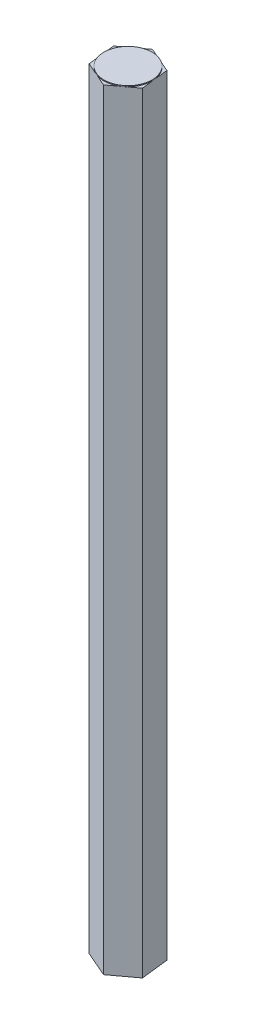
ISO-10303-21;
HEADER;
FILE_DESCRIPTION(('STEP AP214'),'2;1');
FILE_NAME('part.step','',(''),(''),'','','');
FILE_SCHEMA(('AUTOMOTIVE_DESIGN { 1 0 10303 214 1 1 1 1 }'));
ENDSEC;
DATA;
#1=APPLICATION_CONTEXT('core data for automotive mechanical design processes');
#2=APPLICATION_PROTOCOL_DEFINITION('international standard','automotive_design',2000,#1);
#3=PRODUCT_CONTEXT('',#1,'mechanical');
#4=PRODUCT('Part','Part','',(#3));
#5=PRODUCT_RELATED_PRODUCT_CATEGORY('part','',(#4));
#6=PRODUCT_DEFINITION_FORMATION('','',#4);
#7=PRODUCT_DEFINITION_CONTEXT('part definition',#1,'design');
#8=PRODUCT_DEFINITION('design','',#6,#7);
#9=PRODUCT_DEFINITION_SHAPE('','',#8);
#10=(LENGTH_UNIT() NAMED_UNIT(*) SI_UNIT(.MILLI.,.METRE.));
#11=(NAMED_UNIT(*) PLANE_ANGLE_UNIT() SI_UNIT($,.RADIAN.));
#12=(NAMED_UNIT(*) SI_UNIT($,.STERADIAN.) SOLID_ANGLE_UNIT());
#13=UNCERTAINTY_MEASURE_WITH_UNIT(LENGTH_MEASURE(1.E-05),#10,'distance_accuracy_value','');
#14=(GEOMETRIC_REPRESENTATION_CONTEXT(3) GLOBAL_UNCERTAINTY_ASSIGNED_CONTEXT((#13)) GLOBAL_UNIT_ASSIGNED_CONTEXT((#10,
#11,#12)) REPRESENTATION_CONTEXT('',''));
#15=CARTESIAN_POINT('',(0.,0.,0.));
#16=DIRECTION('',(0.,0.,1.));
#17=DIRECTION('',(1.,0.,0.));
#18=AXIS2_PLACEMENT_3D('',#15,#16,#17);
#19=CARTESIAN_POINT('',(0.,203.2,0.));
#20=DIRECTION('',(0.,1.,0.));
#21=DIRECTION('',(0.,0.,1.));
#22=AXIS2_PLACEMENT_3D('',#19,#20,#21);
#23=PLANE('',#22);
#24=CARTESIAN_POINT('',(0.,203.2,0.));
#25=DIRECTION('',(0.,1.,0.));
#26=DIRECTION('',(0.,0.,1.));
#27=AXIS2_PLACEMENT_3D('',#24,#25,#26);
#28=CIRCLE('',#27,6.34999999999998);
#29=CARTESIAN_POINT('',(3.78078422584851,203.2,5.10178112403647));
#30=VERTEX_POINT('',#29);
#31=CARTESIAN_POINT('',(6.30866417088777,203.2,-0.723364623794057));
#32=VERTEX_POINT('',#31);
#33=EDGE_CURVE('E43',#30,#32,#28,.T.);
#34=ORIENTED_EDGE('',*,*,#33,.F.);
#35=DIRECTION('',(0.803430098273463,0.,-0.595399090684806));
#36=VECTOR('',#35,1.);
#37=CARTESIAN_POINT('',(0.835269520539498,203.2,7.284617914578));
#38=LINE('',#37,#36);
#39=CARTESIAN_POINT('',(6.72629893115752,203.2,2.91894433349494));
#40=VERTEX_POINT('',#39);
#41=EDGE_CURVE('E113',#30,#40,#38,.T.);
#42=ORIENTED_EDGE('',*,*,#41,.T.);
#43=DIRECTION('',(-0.113915688786466,0.,-0.99349042061225));
#44=VECTOR('',#43,1.);
#45=CARTESIAN_POINT('',(6.72629893115752,203.2,2.91894433349494));
#46=LINE('',#45,#44);
#47=EDGE_CURVE('E124',#40,#32,#46,.T.);
#48=ORIENTED_EDGE('',*,*,#47,.T.);
#49=EDGE_LOOP('',(#34,#42,#48));
#50=FACE_BOUND('',#49,.T.);
#51=ADVANCED_FACE('F32',(#50),#23,.T.);
#52=CARTESIAN_POINT('',(2.52787994503926,203.2,-5.82514574783053));
#53=VERTEX_POINT('',#52);
#54=EDGE_CURVE('E11',#32,#53,#28,.T.);
#55=ORIENTED_EDGE('',*,*,#54,.F.);
#56=CARTESIAN_POINT('',(5.89102941061802,203.2,-4.36567358108306));
#57=VERTEX_POINT('',#56);
#58=EDGE_CURVE('E136',#32,#57,#46,.T.);
#59=ORIENTED_EDGE('',*,*,#58,.T.);
#60=DIRECTION('',(-0.917345787059928,0.,-0.398091329927444));
#61=VECTOR('',#60,1.);
#62=CARTESIAN_POINT('',(5.89102941061802,203.2,-4.36567358108306));
#63=LINE('',#62,#61);
#64=EDGE_CURVE('E137',#57,#53,#63,.T.);
#65=ORIENTED_EDGE('',*,*,#64,.T.);
#66=EDGE_LOOP('',(#55,#59,#65));
#67=FACE_BOUND('',#66,.T.);
#68=ADVANCED_FACE('F203',(#67),#23,.T.);
#69=CARTESIAN_POINT('',(-3.78078422584851,203.2,-5.10178112403647));
#70=VERTEX_POINT('',#69);
#71=EDGE_CURVE('E41',#53,#70,#28,.T.);
#72=ORIENTED_EDGE('',*,*,#71,.F.);
#73=CARTESIAN_POINT('',(-0.835269520539497,203.2,-7.284617914578));
#74=VERTEX_POINT('',#73);
#75=EDGE_CURVE('E135',#53,#74,#63,.T.);
#76=ORIENTED_EDGE('',*,*,#75,.T.);
#77=DIRECTION('',(-0.803430098273463,0.,0.595399090684806));
#78=VECTOR('',#77,1.);
#79=CARTESIAN_POINT('',(-0.835269520539497,203.2,-7.284617914578));
#80=LINE('',#79,#78);
#81=EDGE_CURVE('E141',#74,#70,#80,.T.);
#82=ORIENTED_EDGE('',*,*,#81,.T.);
#83=EDGE_LOOP('',(#72,#76,#82));
#84=FACE_BOUND('',#83,.T.);
#85=ADVANCED_FACE('F198',(#84),#23,.T.);
#86=CARTESIAN_POINT('',(-6.30866417088776,203.2,0.723364623794055));
#87=VERTEX_POINT('',#86);
#88=EDGE_CURVE('E129',#70,#87,#28,.T.);
#89=ORIENTED_EDGE('',*,*,#88,.F.);
#90=CARTESIAN_POINT('',(-6.72629893115751,203.2,-2.91894433349495));
#91=VERTEX_POINT('',#90);
#92=EDGE_CURVE('E140',#70,#91,#80,.T.);
#93=ORIENTED_EDGE('',*,*,#92,.T.);
#94=DIRECTION('',(0.113915688786466,0.,0.99349042061225));
#95=VECTOR('',#94,1.);
#96=CARTESIAN_POINT('',(-6.72629893115751,203.2,-2.91894433349495));
#97=LINE('',#96,#95);
#98=EDGE_CURVE('E145',#91,#87,#97,.T.);
#99=ORIENTED_EDGE('',*,*,#98,.T.);
#100=EDGE_LOOP('',(#89,#93,#99));
#101=FACE_BOUND('',#100,.T.);
#102=ADVANCED_FACE('F195',(#101),#23,.T.);
#103=CARTESIAN_POINT('',(-2.52787994503926,203.2,5.82514574783053));
#104=VERTEX_POINT('',#103);
#105=EDGE_CURVE('E58',#87,#104,#28,.T.);
#106=ORIENTED_EDGE('',*,*,#105,.F.);
#107=CARTESIAN_POINT('',(-5.89102941061801,203.2,4.36567358108306));
#108=VERTEX_POINT('',#107);
#109=EDGE_CURVE('E144',#87,#108,#97,.T.);
#110=ORIENTED_EDGE('',*,*,#109,.T.);
#111=DIRECTION('',(0.917345787059928,0.,0.398091329927444));
#112=VECTOR('',#111,1.);
#113=CARTESIAN_POINT('',(-5.89102941061801,203.2,4.36567358108306));
#114=LINE('',#113,#112);
#115=EDGE_CURVE('E122',#108,#104,#114,.T.);
#116=ORIENTED_EDGE('',*,*,#115,.T.);
#117=EDGE_LOOP('',(#106,#110,#116));
#118=FACE_BOUND('',#117,.T.);
#119=ADVANCED_FACE('F193',(#118),#23,.T.);
#120=CARTESIAN_POINT('',(6.72629893115752,203.2,2.91894433349494));
#121=DIRECTION('',(-0.99349042061225,0.,0.113915688786466));
#122=DIRECTION('',(0.113915688786466,0.,0.99349042061225));
#123=AXIS2_PLACEMENT_3D('',#120,#121,#122);
#124=PLANE('',#123);
#125=DIRECTION('',(-0.113915688786466,0.,-0.99349042061225));
#126=VECTOR('',#125,1.);
#127=CARTESIAN_POINT('',(6.72629893115752,0.,2.91894433349494));
#128=LINE('',#127,#126);
#129=CARTESIAN_POINT('',(6.72629893115752,0.,2.91894433349494));
#130=VERTEX_POINT('',#129);
#131=CARTESIAN_POINT('',(5.89102941061802,0.,-4.36567358108306));
#132=VERTEX_POINT('',#131);
#133=EDGE_CURVE('E149',#130,#132,#128,.T.);
#134=ORIENTED_EDGE('',*,*,#133,.T.);
#135=DIRECTION('',(0.,-1.,0.));
#136=VECTOR('',#135,1.);
#137=CARTESIAN_POINT('',(5.89102941061802,203.2,-4.36567358108306));
#138=LINE('',#137,#136);
#139=EDGE_CURVE('E36',#57,#132,#138,.T.);
#140=ORIENTED_EDGE('',*,*,#139,.F.);
#141=ORIENTED_EDGE('',*,*,#58,.F.);
#142=ORIENTED_EDGE('',*,*,#47,.F.);
#143=DIRECTION('',(0.,-1.,0.));
#144=VECTOR('',#143,1.);
#145=CARTESIAN_POINT('',(6.72629893115752,203.2,2.91894433349494));
#146=LINE('',#145,#144);
#147=EDGE_CURVE('E112',#40,#130,#146,.T.);
#148=ORIENTED_EDGE('',*,*,#147,.T.);
#149=EDGE_LOOP('',(#134,#140,#141,#142,#148));
#150=FACE_BOUND('',#149,.T.);
#151=ADVANCED_FACE('F34',(#150),#124,.F.);
#152=CARTESIAN_POINT('',(5.89102941061802,203.2,-4.36567358108306));
#153=DIRECTION('',(-0.398091329927444,0.,0.917345787059928));
#154=DIRECTION('',(0.917345787059928,0.,0.398091329927444));
#155=AXIS2_PLACEMENT_3D('',#152,#153,#154);
#156=PLANE('',#155);
#157=DIRECTION('',(-0.917345787059928,0.,-0.398091329927444));
#158=VECTOR('',#157,1.);
#159=CARTESIAN_POINT('',(5.89102941061802,0.,-4.36567358108306));
#160=LINE('',#159,#158);
#161=CARTESIAN_POINT('',(-0.835269520539497,0.,-7.284617914578));
#162=VERTEX_POINT('',#161);
#163=EDGE_CURVE('E152',#132,#162,#160,.T.);
#164=ORIENTED_EDGE('',*,*,#163,.T.);
#165=DIRECTION('',(0.,-1.,0.));
#166=VECTOR('',#165,1.);
#167=CARTESIAN_POINT('',(-0.835269520539497,203.2,-7.284617914578));
#168=LINE('',#167,#166);
#169=EDGE_CURVE('E131',#74,#162,#168,.T.);
#170=ORIENTED_EDGE('',*,*,#169,.F.);
#171=ORIENTED_EDGE('',*,*,#75,.F.);
#172=ORIENTED_EDGE('',*,*,#64,.F.);
#173=ORIENTED_EDGE('',*,*,#139,.T.);
#174=EDGE_LOOP('',(#164,#170,#171,#172,#173));
#175=FACE_BOUND('',#174,.T.);
#176=ADVANCED_FACE('F200',(#175),#156,.F.);
#177=CARTESIAN_POINT('',(-0.835269520539497,203.2,-7.284617914578));
#178=DIRECTION('',(0.595399090684806,0.,0.803430098273463));
#179=DIRECTION('',(0.803430098273463,0.,-0.595399090684806));
#180=AXIS2_PLACEMENT_3D('',#177,#178,#179);
#181=PLANE('',#180);
#182=DIRECTION('',(-0.803430098273463,0.,0.595399090684806));
#183=VECTOR('',#182,1.);
#184=CARTESIAN_POINT('',(-0.835269520539497,0.,-7.284617914578));
#185=LINE('',#184,#183);
#186=CARTESIAN_POINT('',(-6.72629893115751,0.,-2.91894433349495));
#187=VERTEX_POINT('',#186);
#188=EDGE_CURVE('E154',#162,#187,#185,.T.);
#189=ORIENTED_EDGE('',*,*,#188,.T.);
#190=DIRECTION('',(0.,-1.,0.));
#191=VECTOR('',#190,1.);
#192=CARTESIAN_POINT('',(-6.72629893115751,203.2,-2.91894433349495));
#193=LINE('',#192,#191);
#194=EDGE_CURVE('E168',#91,#187,#193,.T.);
#195=ORIENTED_EDGE('',*,*,#194,.F.);
#196=ORIENTED_EDGE('',*,*,#92,.F.);
#197=ORIENTED_EDGE('',*,*,#81,.F.);
#198=ORIENTED_EDGE('',*,*,#169,.T.);
#199=EDGE_LOOP('',(#189,#195,#196,#197,#198));
#200=FACE_BOUND('',#199,.T.);
#201=ADVANCED_FACE('F175',(#200),#181,.F.);
#202=CARTESIAN_POINT('',(-6.72629893115751,203.2,-2.91894433349495));
#203=DIRECTION('',(0.99349042061225,0.,-0.113915688786466));
#204=DIRECTION('',(-0.113915688786466,0.,-0.99349042061225));
#205=AXIS2_PLACEMENT_3D('',#202,#203,#204);
#206=PLANE('',#205);
#207=DIRECTION('',(0.113915688786466,0.,0.99349042061225));
#208=VECTOR('',#207,1.);
#209=CARTESIAN_POINT('',(-6.72629893115751,0.,-2.91894433349495));
#210=LINE('',#209,#208);
#211=CARTESIAN_POINT('',(-5.89102941061801,0.,4.36567358108306));
#212=VERTEX_POINT('',#211);
#213=EDGE_CURVE('E156',#187,#212,#210,.T.);
#214=ORIENTED_EDGE('',*,*,#213,.T.);
#215=DIRECTION('',(0.,-1.,0.));
#216=VECTOR('',#215,1.);
#217=CARTESIAN_POINT('',(-5.89102941061801,203.2,4.36567358108306));
#218=LINE('',#217,#216);
#219=EDGE_CURVE('E165',#108,#212,#218,.T.);
#220=ORIENTED_EDGE('',*,*,#219,.F.);
#221=ORIENTED_EDGE('',*,*,#109,.F.);
#222=ORIENTED_EDGE('',*,*,#98,.F.);
#223=ORIENTED_EDGE('',*,*,#194,.T.);
#224=EDGE_LOOP('',(#214,#220,#221,#222,#223));
#225=FACE_BOUND('',#224,.T.);
#226=ADVANCED_FACE('F188',(#225),#206,.F.);
#227=CARTESIAN_POINT('',(-5.89102941061801,203.2,4.36567358108306));
#228=DIRECTION('',(0.398091329927444,0.,-0.917345787059928));
#229=DIRECTION('',(-0.917345787059928,0.,-0.398091329927444));
#230=AXIS2_PLACEMENT_3D('',#227,#228,#229);
#231=PLANE('',#230);
#232=DIRECTION('',(0.917345787059928,0.,0.398091329927444));
#233=VECTOR('',#232,1.);
#234=CARTESIAN_POINT('',(-5.89102941061801,0.,4.36567358108306));
#235=LINE('',#234,#233);
#236=CARTESIAN_POINT('',(0.835269520539498,0.,7.284617914578));
#237=VERTEX_POINT('',#236);
#238=EDGE_CURVE('E158',#212,#237,#235,.T.);
#239=ORIENTED_EDGE('',*,*,#238,.T.);
#240=DIRECTION('',(0.,-1.,0.));
#241=VECTOR('',#240,1.);
#242=CARTESIAN_POINT('',(0.835269520539498,203.2,7.284617914578));
#243=LINE('',#242,#241);
#244=CARTESIAN_POINT('',(0.835269520539498,203.2,7.284617914578));
#245=VERTEX_POINT('',#244);
#246=EDGE_CURVE('E163',#245,#237,#243,.T.);
#247=ORIENTED_EDGE('',*,*,#246,.F.);
#248=EDGE_CURVE('E108',#104,#245,#114,.T.);
#249=ORIENTED_EDGE('',*,*,#248,.F.);
#250=ORIENTED_EDGE('',*,*,#115,.F.);
#251=ORIENTED_EDGE('',*,*,#219,.T.);
#252=EDGE_LOOP('',(#239,#247,#249,#250,#251));
#253=FACE_BOUND('',#252,.T.);
#254=ADVANCED_FACE('F192',(#253),#231,.F.);
#255=CARTESIAN_POINT('',(0.835269520539498,203.2,7.284617914578));
#256=DIRECTION('',(-0.595399090684806,0.,-0.803430098273463));
#257=DIRECTION('',(-0.803430098273463,0.,0.595399090684806));
#258=AXIS2_PLACEMENT_3D('',#255,#256,#257);
#259=PLANE('',#258);
#260=DIRECTION('',(0.803430098273463,0.,-0.595399090684806));
#261=VECTOR('',#260,1.);
#262=CARTESIAN_POINT('',(0.835269520539498,0.,7.284617914578));
#263=LINE('',#262,#261);
#264=EDGE_CURVE('E160',#237,#130,#263,.T.);
#265=ORIENTED_EDGE('',*,*,#264,.T.);
#266=ORIENTED_EDGE('',*,*,#147,.F.);
#267=ORIENTED_EDGE('',*,*,#41,.F.);
#268=EDGE_CURVE('E105',#245,#30,#38,.T.);
#269=ORIENTED_EDGE('',*,*,#268,.F.);
#270=ORIENTED_EDGE('',*,*,#246,.T.);
#271=EDGE_LOOP('',(#265,#266,#267,#269,#270));
#272=FACE_BOUND('',#271,.T.);
#273=ADVANCED_FACE('F117',(#272),#259,.F.);
#274=EDGE_CURVE('E50',#104,#30,#28,.T.);
#275=ORIENTED_EDGE('',*,*,#274,.F.);
#276=ORIENTED_EDGE('',*,*,#248,.T.);
#277=ORIENTED_EDGE('',*,*,#268,.T.);
#278=EDGE_LOOP('',(#275,#276,#277));
#279=FACE_BOUND('',#278,.T.);
#280=ADVANCED_FACE('F107',(#279),#23,.T.);
#281=CARTESIAN_POINT('',(0.,0.,0.));
#282=DIRECTION('',(0.,1.,0.));
#283=DIRECTION('',(0.,0.,1.));
#284=AXIS2_PLACEMENT_3D('',#281,#282,#283);
#285=PLANE('',#284);
#286=ORIENTED_EDGE('',*,*,#133,.F.);
#287=ORIENTED_EDGE('',*,*,#264,.F.);
#288=ORIENTED_EDGE('',*,*,#238,.F.);
#289=ORIENTED_EDGE('',*,*,#213,.F.);
#290=ORIENTED_EDGE('',*,*,#188,.F.);
#291=ORIENTED_EDGE('',*,*,#163,.F.);
#292=EDGE_LOOP('',(#286,#287,#288,#289,#290,#291));
#293=FACE_BOUND('',#292,.T.);
#294=ADVANCED_FACE('F183',(#293),#285,.F.);
#295=CARTESIAN_POINT('',(0.,203.454,0.));
#296=DIRECTION('',(0.,-1.,0.));
#297=DIRECTION('',(0.,0.,-1.));
#298=AXIS2_PLACEMENT_3D('',#295,#296,#297);
#299=CYLINDRICAL_SURFACE('',#298,6.34999999999998);
#300=CARTESIAN_POINT('',(0.,203.454,0.));
#301=DIRECTION('',(0.,1.,0.));
#302=DIRECTION('',(0.,0.,1.));
#303=AXIS2_PLACEMENT_3D('',#300,#301,#302);
#304=CIRCLE('',#303,6.34999999999998);
#305=CARTESIAN_POINT('',(0.,203.454,6.34999999999998));
#306=VERTEX_POINT('',#305);
#307=EDGE_CURVE('E126',#306,#306,#304,.T.);
#308=ORIENTED_EDGE('',*,*,#307,.F.);
#309=EDGE_LOOP('',(#308));
#310=FACE_BOUND('',#309,.T.);
#311=ORIENTED_EDGE('',*,*,#33,.T.);
#312=ORIENTED_EDGE('',*,*,#54,.T.);
#313=ORIENTED_EDGE('',*,*,#71,.T.);
#314=ORIENTED_EDGE('',*,*,#88,.T.);
#315=ORIENTED_EDGE('',*,*,#105,.T.);
#316=ORIENTED_EDGE('',*,*,#274,.T.);
#317=EDGE_LOOP('',(#311,#312,#313,#314,#315,#316));
#318=FACE_BOUND('',#317,.T.);
#319=ADVANCED_FACE('F127',(#310,#318),#299,.T.);
#320=CARTESIAN_POINT('',(0.,203.454,0.));
#321=DIRECTION('',(0.,1.,0.));
#322=DIRECTION('',(0.,0.,1.));
#323=AXIS2_PLACEMENT_3D('',#320,#321,#322);
#324=PLANE('',#323);
#325=ORIENTED_EDGE('',*,*,#307,.T.);
#326=EDGE_LOOP('',(#325));
#327=FACE_BOUND('',#326,.T.);
#328=ADVANCED_FACE('F262',(#327),#324,.T.);
#329=CLOSED_SHELL('',(#51,#68,#85,#102,#119,#151,#176,#201,#226,#254,#273,#280,#294,#319,#328));
#330=MANIFOLD_SOLID_BREP('B2',#329);
#331=ADVANCED_BREP_SHAPE_REPRESENTATION('',(#18,#330),#14);
#332=SHAPE_DEFINITION_REPRESENTATION(#9,#331);
ENDSEC;
END-ISO-10303-21;
